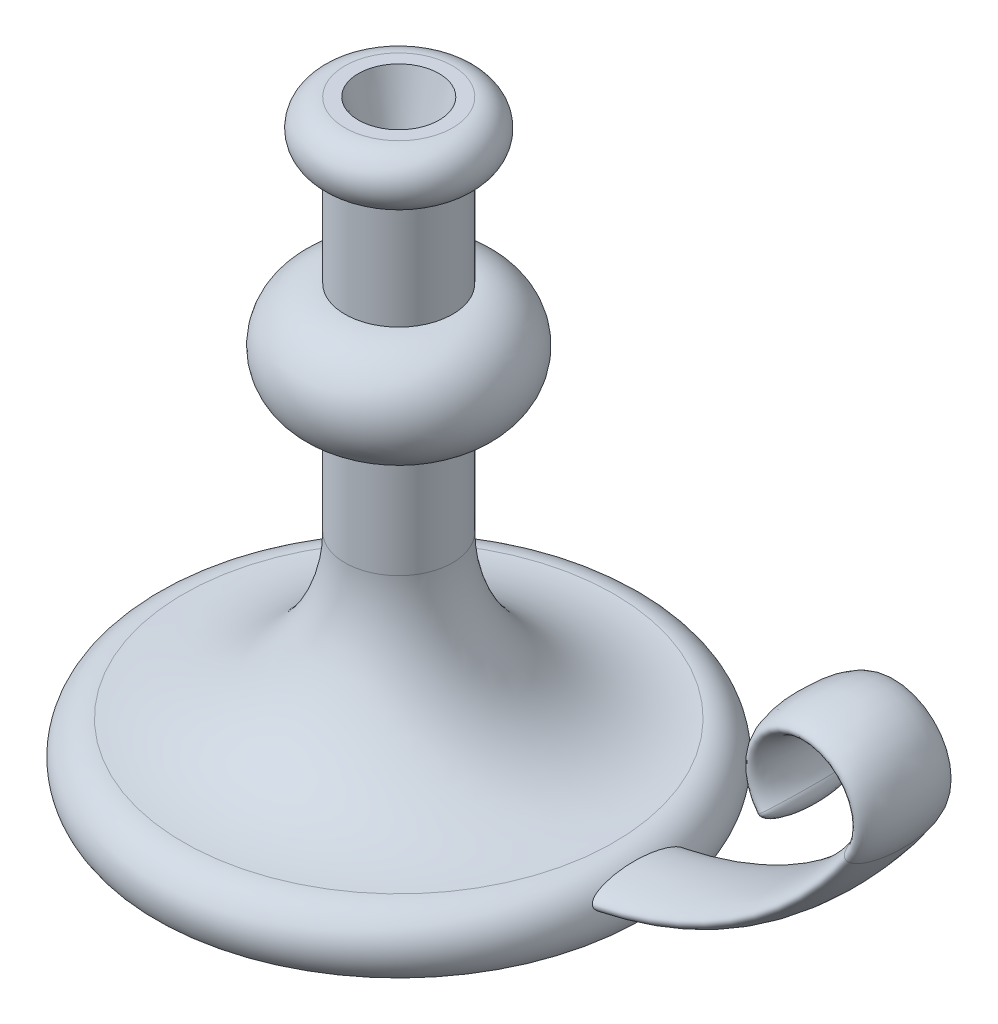
ISO-10303-21;
HEADER;
FILE_DESCRIPTION(('STEP AP214'),'2;1');
FILE_NAME('part.step','',(''),(''),'','','');
FILE_SCHEMA(('AUTOMOTIVE_DESIGN { 1 0 10303 214 1 1 1 1 }'));
ENDSEC;
DATA;
#1=APPLICATION_CONTEXT('core data for automotive mechanical design processes');
#2=APPLICATION_PROTOCOL_DEFINITION('international standard','automotive_design',2000,#1);
#3=PRODUCT_CONTEXT('',#1,'mechanical');
#4=PRODUCT('Part','Part','',(#3));
#5=PRODUCT_RELATED_PRODUCT_CATEGORY('part','',(#4));
#6=PRODUCT_DEFINITION_FORMATION('','',#4);
#7=PRODUCT_DEFINITION_CONTEXT('part definition',#1,'design');
#8=PRODUCT_DEFINITION('design','',#6,#7);
#9=PRODUCT_DEFINITION_SHAPE('','',#8);
#10=(LENGTH_UNIT() NAMED_UNIT(*) SI_UNIT(.MILLI.,.METRE.));
#11=(NAMED_UNIT(*) PLANE_ANGLE_UNIT() SI_UNIT($,.RADIAN.));
#12=(NAMED_UNIT(*) SI_UNIT($,.STERADIAN.) SOLID_ANGLE_UNIT());
#13=UNCERTAINTY_MEASURE_WITH_UNIT(LENGTH_MEASURE(1.E-05),#10,'distance_accuracy_value','');
#14=(GEOMETRIC_REPRESENTATION_CONTEXT(3) GLOBAL_UNCERTAINTY_ASSIGNED_CONTEXT((#13)) GLOBAL_UNIT_ASSIGNED_CONTEXT((#10,
#11,#12)) REPRESENTATION_CONTEXT('',''));
#15=CARTESIAN_POINT('',(0.,0.,0.));
#16=DIRECTION('',(0.,0.,1.));
#17=DIRECTION('',(1.,0.,0.));
#18=AXIS2_PLACEMENT_3D('',#15,#16,#17);
#19=CARTESIAN_POINT('',(0.,0.,0.));
#20=DIRECTION('',(0.,-1.,0.));
#21=DIRECTION('',(0.,0.,-1.));
#22=AXIS2_PLACEMENT_3D('',#19,#20,#21);
#23=PLANE('',#22);
#24=CARTESIAN_POINT('',(0.,0.,0.));
#25=DIRECTION('',(0.,-1.,0.));
#26=DIRECTION('',(0.,0.,-1.));
#27=AXIS2_PLACEMENT_3D('',#24,#25,#26);
#28=CIRCLE('',#27,90.);
#29=CARTESIAN_POINT('',(0.,0.,-90.));
#30=VERTEX_POINT('',#29);
#31=EDGE_CURVE('E69',#30,#30,#28,.T.);
#32=ORIENTED_EDGE('',*,*,#31,.T.);
#33=EDGE_LOOP('',(#32));
#34=FACE_BOUND('',#33,.T.);
#35=ADVANCED_FACE('F47',(#34),#23,.T.);
#36=CARTESIAN_POINT('',(0.,220.,0.));
#37=DIRECTION('',(0.,1.,0.));
#38=DIRECTION('',(0.,0.,1.));
#39=AXIS2_PLACEMENT_3D('',#36,#37,#38);
#40=PLANE('',#39);
#41=CARTESIAN_POINT('',(0.,220.,0.));
#42=DIRECTION('',(0.,1.,0.));
#43=DIRECTION('',(0.,0.,1.));
#44=AXIS2_PLACEMENT_3D('',#41,#42,#43);
#45=CIRCLE('',#44,15.);
#46=CARTESIAN_POINT('',(0.,220.,15.));
#47=VERTEX_POINT('',#46);
#48=EDGE_CURVE('E80',#47,#47,#45,.T.);
#49=ORIENTED_EDGE('',*,*,#48,.F.);
#50=EDGE_LOOP('',(#49));
#51=FACE_BOUND('',#50,.T.);
#52=CARTESIAN_POINT('',(0.,220.,0.));
#53=DIRECTION('',(0.,-1.,0.));
#54=DIRECTION('',(0.,0.,-1.));
#55=AXIS2_PLACEMENT_3D('',#52,#53,#54);
#56=CIRCLE('',#55,20.);
#57=CARTESIAN_POINT('',(0.,220.,-20.));
#58=VERTEX_POINT('',#57);
#59=EDGE_CURVE('E59',#58,#58,#56,.T.);
#60=ORIENTED_EDGE('',*,*,#59,.F.);
#61=EDGE_LOOP('',(#60));
#62=FACE_BOUND('',#61,.T.);
#63=ADVANCED_FACE('F130',(#51,#62),#40,.T.);
#64=CARTESIAN_POINT('',(0.,210.,0.));
#65=DIRECTION('',(0.,-1.,0.));
#66=DIRECTION('',(0.,0.,-1.));
#67=AXIS2_PLACEMENT_3D('',#64,#65,#66);
#68=TOROIDAL_SURFACE('',#67,20.,10.);
#69=ORIENTED_EDGE('',*,*,#59,.T.);
#70=EDGE_LOOP('',(#69));
#71=FACE_BOUND('',#70,.T.);
#72=CARTESIAN_POINT('',(0.,200.,0.));
#73=DIRECTION('',(0.,-1.,0.));
#74=DIRECTION('',(0.,0.,-1.));
#75=AXIS2_PLACEMENT_3D('',#72,#73,#74);
#76=CIRCLE('',#75,20.);
#77=CARTESIAN_POINT('',(0.,200.,-20.));
#78=VERTEX_POINT('',#77);
#79=EDGE_CURVE('E105',#78,#78,#76,.T.);
#80=ORIENTED_EDGE('',*,*,#79,.F.);
#81=EDGE_LOOP('',(#80));
#82=FACE_BOUND('',#81,.T.);
#83=ADVANCED_FACE('F135',(#71,#82),#68,.T.);
#84=CARTESIAN_POINT('',(0.,0.,0.));
#85=DIRECTION('',(0.,-1.,0.));
#86=DIRECTION('',(0.,0.,-1.));
#87=AXIS2_PLACEMENT_3D('',#84,#85,#86);
#88=CYLINDRICAL_SURFACE('',#87,20.);
#89=ORIENTED_EDGE('',*,*,#79,.T.);
#90=EDGE_LOOP('',(#89));
#91=FACE_BOUND('',#90,.T.);
#92=CARTESIAN_POINT('',(0.,160.,0.));
#93=DIRECTION('',(0.,-1.,0.));
#94=DIRECTION('',(0.,0.,-1.));
#95=AXIS2_PLACEMENT_3D('',#92,#93,#94);
#96=CIRCLE('',#95,20.);
#97=CARTESIAN_POINT('',(0.,160.,-20.));
#98=VERTEX_POINT('',#97);
#99=EDGE_CURVE('E108',#98,#98,#96,.T.);
#100=ORIENTED_EDGE('',*,*,#99,.F.);
#101=EDGE_LOOP('',(#100));
#102=FACE_BOUND('',#101,.T.);
#103=ADVANCED_FACE('F141',(#91,#102),#88,.T.);
#104=CARTESIAN_POINT('',(0.,140.,0.));
#105=DIRECTION('',(0.,-1.,0.));
#106=DIRECTION('',(0.,0.,-1.));
#107=AXIS2_PLACEMENT_3D('',#104,#105,#106);
#108=TOROIDAL_SURFACE('',#107,20.,20.);
#109=ORIENTED_EDGE('',*,*,#99,.T.);
#110=EDGE_LOOP('',(#109));
#111=FACE_BOUND('',#110,.T.);
#112=CARTESIAN_POINT('',(0.,120.,0.));
#113=DIRECTION('',(0.,-1.,0.));
#114=DIRECTION('',(0.,0.,-1.));
#115=AXIS2_PLACEMENT_3D('',#112,#113,#114);
#116=CIRCLE('',#115,20.);
#117=CARTESIAN_POINT('',(0.,120.,-20.));
#118=VERTEX_POINT('',#117);
#119=EDGE_CURVE('E111',#118,#118,#116,.T.);
#120=ORIENTED_EDGE('',*,*,#119,.F.);
#121=EDGE_LOOP('',(#120));
#122=FACE_BOUND('',#121,.T.);
#123=ADVANCED_FACE('F127',(#111,#122),#108,.T.);
#124=CARTESIAN_POINT('',(0.,0.,0.));
#125=DIRECTION('',(0.,-1.,0.));
#126=DIRECTION('',(0.,0.,-1.));
#127=AXIS2_PLACEMENT_3D('',#124,#125,#126);
#128=CYLINDRICAL_SURFACE('',#127,20.);
#129=ORIENTED_EDGE('',*,*,#119,.T.);
#130=EDGE_LOOP('',(#129));
#131=FACE_BOUND('',#130,.T.);
#132=CARTESIAN_POINT('',(0.,79.9999999999999,0.));
#133=DIRECTION('',(0.,-1.,0.));
#134=DIRECTION('',(0.,0.,-1.));
#135=AXIS2_PLACEMENT_3D('',#132,#133,#134);
#136=CIRCLE('',#135,20.);
#137=CARTESIAN_POINT('',(0.,79.9999999999999,-20.));
#138=VERTEX_POINT('',#137);
#139=EDGE_CURVE('E114',#138,#138,#136,.T.);
#140=ORIENTED_EDGE('',*,*,#139,.F.);
#141=EDGE_LOOP('',(#140));
#142=FACE_BOUND('',#141,.T.);
#143=ADVANCED_FACE('F122',(#131,#142),#128,.T.);
#144=CARTESIAN_POINT('',(0.,80.,0.));
#145=DIRECTION('',(0.,-1.,0.));
#146=DIRECTION('',(0.,0.,-1.));
#147=AXIS2_PLACEMENT_3D('',#144,#145,#146);
#148=TOROIDAL_SURFACE('',#147,80.,60.);
#149=ORIENTED_EDGE('',*,*,#139,.T.);
#150=EDGE_LOOP('',(#149));
#151=FACE_BOUND('',#150,.T.);
#152=CARTESIAN_POINT('',(0.,20.,0.));
#153=DIRECTION('',(0.,-1.,0.));
#154=DIRECTION('',(0.,0.,-1.));
#155=AXIS2_PLACEMENT_3D('',#152,#153,#154);
#156=CIRCLE('',#155,79.9999999999999);
#157=CARTESIAN_POINT('',(0.,20.,-79.9999999999999));
#158=VERTEX_POINT('',#157);
#159=EDGE_CURVE('E72',#158,#158,#156,.T.);
#160=ORIENTED_EDGE('',*,*,#159,.F.);
#161=EDGE_LOOP('',(#160));
#162=FACE_BOUND('',#161,.T.);
#163=ADVANCED_FACE('F97',(#151,#162),#148,.F.);
#164=CARTESIAN_POINT('',(0.,7.49999999999997,0.));
#165=DIRECTION('',(0.,-1.,0.));
#166=DIRECTION('',(0.,0.,-1.));
#167=AXIS2_PLACEMENT_3D('',#164,#165,#166);
#168=TOROIDAL_SURFACE('',#167,80.,12.5);
#169=CARTESIAN_POINT('',(89.5597422043341,12.9414346567555,-17.5));
#170=CARTESIAN_POINT('',(89.5390682417034,12.9833970763635,-17.499999801476));
#171=CARTESIAN_POINT('',(89.5184948481192,13.0254081758614,-17.4978460786373));
#172=CARTESIAN_POINT('',(89.4777074557659,13.1091783719493,-17.4892930018231));
#173=CARTESIAN_POINT('',(89.4574935851384,13.1509373753176,-17.4828921640349));
#174=CARTESIAN_POINT('',(89.3975656488552,13.275424618129,-17.4575317742508));
#175=CARTESIAN_POINT('',(89.3585930347989,13.3573066164347,-17.4324146791396));
#176=CARTESIAN_POINT('',(89.2734409816765,13.5379175715786,-17.3597432795598));
#177=CARTESIAN_POINT('',(89.2281121247516,13.6353143232492,-17.3079911474062));
#178=CARTESIAN_POINT('',(89.1421571121494,13.8217561384483,-17.188166079603));
#179=CARTESIAN_POINT('',(89.1015411563844,13.9107830112797,-17.1200586894139));
#180=CARTESIAN_POINT('',(89.0298762971165,14.0690143319055,-16.9825248110395));
#181=CARTESIAN_POINT('',(88.9982786842444,14.1392645151031,-16.9145529225411));
#182=CARTESIAN_POINT('',(88.9378306664439,14.2743203741629,-16.7722185271802));
#183=CARTESIAN_POINT('',(88.9089824882069,14.3391216321741,-16.6978509317863));
#184=CARTESIAN_POINT('',(88.8535955575884,14.4639952815646,-16.5441752211162));
#185=CARTESIAN_POINT('',(88.8270622241569,14.5240565470721,-16.46485622146));
#186=CARTESIAN_POINT('',(88.7760324990848,14.6398694069749,-16.3025689169612));
#187=CARTESIAN_POINT('',(88.7515354717388,14.6956223459825,-16.2196017634808));
#188=CARTESIAN_POINT('',(88.7047417294347,14.8022966462375,-16.0524591820992));
#189=CARTESIAN_POINT('',(88.6824111309148,14.8532916472491,-15.9683399173082));
#190=CARTESIAN_POINT('',(88.6391880618339,14.9520793339757,-15.79787361839));
#191=CARTESIAN_POINT('',(88.6182958325685,14.9998714823562,-15.7115262138022));
#192=CARTESIAN_POINT('',(88.5574287556144,15.1391199588383,-15.4495202070302));
#193=CARTESIAN_POINT('',(88.5193306885353,15.226294697945,-15.2711446093403));
#194=CARTESIAN_POINT('',(88.446993084953,15.3914560839503,-14.9093240436536));
#195=CARTESIAN_POINT('',(88.4127567918464,15.4694350100039,-14.7258749732316));
#196=CARTESIAN_POINT('',(88.3472362016713,15.6180770700463,-14.3544014869799));
#197=CARTESIAN_POINT('',(88.3159681826398,15.6887000486783,-14.1663582382782));
#198=CARTESIAN_POINT('',(88.2560646079385,15.8232632193262,-13.7877426015728));
#199=CARTESIAN_POINT('',(88.2274261580788,15.8872107694164,-13.597173264885));
#200=CARTESIAN_POINT('',(88.1723521282147,16.0093779596914,-13.2139752998446));
#201=CARTESIAN_POINT('',(88.1459158137057,16.0675995109174,-13.0213473824982));
#202=CARTESIAN_POINT('',(88.0881587196921,16.1938504755765,-12.5829461756595));
#203=CARTESIAN_POINT('',(88.057408826797,16.2603701176449,-12.3366637905587));
#204=CARTESIAN_POINT('',(87.9985123187221,16.3864590847676,-11.8420048197334));
#205=CARTESIAN_POINT('',(87.9703659750279,16.4460276851697,-11.5936280185532));
#206=CARTESIAN_POINT('',(87.9163482586829,16.5590946330449,-11.0949310622544));
#207=CARTESIAN_POINT('',(87.8904797303634,16.612585414613,-10.8446088905718));
#208=CARTESIAN_POINT('',(87.8408483965671,16.7140512465655,-10.3426370646263));
#209=CARTESIAN_POINT('',(87.8170856939001,16.7620260276842,-10.0909873461855));
#210=CARTESIAN_POINT('',(87.7486691228052,16.898583923083,-9.33377768592114));
#211=CARTESIAN_POINT('',(87.7069540377653,16.97966087202,-8.82658708533074));
#212=CARTESIAN_POINT('',(87.6306961124076,17.1248455016836,-7.80916406760192));
#213=CARTESIAN_POINT('',(87.5961551600074,17.1889487168833,-7.2989308860368));
#214=CARTESIAN_POINT('',(87.5339911377833,17.3022548727761,-6.27558535996727));
#215=CARTESIAN_POINT('',(87.5063790759952,17.3514341291621,-5.76246974165502));
#216=CARTESIAN_POINT('',(87.4581556376937,17.436100662932,-4.73533825840298));
#217=CARTESIAN_POINT('',(87.4375369377591,17.471602268827,-4.22132390532781));
#218=CARTESIAN_POINT('',(87.4033485965417,17.5298933049627,-3.19263203564266));
#219=CARTESIAN_POINT('',(87.3897750436296,17.5526897899013,-2.67795504642817));
#220=CARTESIAN_POINT('',(87.3697503063743,17.586157334674,-1.648164156787));
#221=CARTESIAN_POINT('',(87.3632979000101,17.5968304749382,-1.13305034650892));
#222=CARTESIAN_POINT('',(87.3567446403376,17.60768667733,0.0451925107298317));
#223=CARTESIAN_POINT('',(87.3589979794371,17.6039802512045,0.708375187512295));
#224=CARTESIAN_POINT('',(87.3753603536129,17.5767998431173,2.03444017536747));
#225=CARTESIAN_POINT('',(87.3894738801434,17.5533183723369,2.69732227744506));
#226=CARTESIAN_POINT('',(87.4294012787108,17.4856044911544,4.02207693580371));
#227=CARTESIAN_POINT('',(87.4552221149226,17.441359729014,4.68394865557875));
#228=CARTESIAN_POINT('',(87.5182601373714,17.3304493690439,6.00273083681723));
#229=CARTESIAN_POINT('',(87.5554327085335,17.2638714468588,6.65965058375248));
#230=CARTESIAN_POINT('',(87.6198336832517,17.1447808230946,7.6419645780698));
#231=CARTESIAN_POINT('',(87.642735706184,17.1018902548719,7.96882803392315));
#232=CARTESIAN_POINT('',(87.6915021526184,17.0091104096816,8.62133363379236));
#233=CARTESIAN_POINT('',(87.7173664470652,16.9592214375876,8.94697583037616));
#234=CARTESIAN_POINT('',(87.7721755297607,16.8517641144648,9.59646350792249));
#235=CARTESIAN_POINT('',(87.8011178051594,16.7942020181563,9.92031023084742));
#236=CARTESIAN_POINT('',(87.8623401784715,16.6704243890004,10.5660151582703));
#237=CARTESIAN_POINT('',(87.8946200133658,16.604209537932,10.8878735173476));
#238=CARTESIAN_POINT('',(87.9634236652183,16.4608004427525,11.5338084512996));
#239=CARTESIAN_POINT('',(88.000003820403,16.3834565668026,11.8578460140784));
#240=CARTESIAN_POINT('',(88.0776704479077,16.2167402960612,12.5024294932673));
#241=CARTESIAN_POINT('',(88.1187582871155,16.127364250818,12.8229743179843));
#242=CARTESIAN_POINT('',(88.1845991136114,15.9822640377111,13.3001792679787));
#243=CARTESIAN_POINT('',(88.2072711562738,15.9320048353494,13.4587947763663));
#244=CARTESIAN_POINT('',(88.2542087743505,15.8273740345263,13.7744208617844));
#245=CARTESIAN_POINT('',(88.2784742329896,15.7730027373801,13.9314315554533));
#246=CARTESIAN_POINT('',(88.3288329339648,15.6596363065337,14.2433947335179));
#247=CARTESIAN_POINT('',(88.35492524545,15.6006435258591,14.3983482189411));
#248=CARTESIAN_POINT('',(88.40926963883,15.4773352517471,14.7057236901241));
#249=CARTESIAN_POINT('',(88.4375213946573,15.4130205617763,14.8581460538589));
#250=CARTESIAN_POINT('',(88.496850771984,15.277656295013,15.1609091928659));
#251=CARTESIAN_POINT('',(88.5279487218459,15.2065580859198,15.3112244481864));
#252=CARTESIAN_POINT('',(88.5933850994808,15.056867767975,15.6074204461988));
#253=CARTESIAN_POINT('',(88.6277241675827,14.9782741782727,15.7533003050569));
#254=CARTESIAN_POINT('',(88.700244119066,14.8125407512923,16.0379741363778));
#255=CARTESIAN_POINT('',(88.7383996400976,14.725457419618,16.1768067090681));
#256=CARTESIAN_POINT('',(88.7994889081876,14.5866042208326,16.3782369433242));
#257=CARTESIAN_POINT('',(88.8204977413205,14.5389415031643,16.4442523217283));
#258=CARTESIAN_POINT('',(88.8639845053446,14.4405581400305,16.5734496387427));
#259=CARTESIAN_POINT('',(88.8864621846825,14.3898380182878,16.6366320594137));
#260=CARTESIAN_POINT('',(88.9422432981294,14.2644224068509,16.7835876842878));
#261=CARTESIAN_POINT('',(88.9763364041371,14.1881224618902,16.8657235531488));
#262=CARTESIAN_POINT('',(89.0483213192228,14.0281384901631,17.0203903295102));
#263=CARTESIAN_POINT('',(89.0862061390444,13.9444680822846,17.0929383574416));
#264=CARTESIAN_POINT('',(89.167031158357,13.7675914637806,17.2256585134379));
#265=CARTESIAN_POINT('',(89.2100345714238,13.6742683967952,17.2856436508916));
#266=CARTESIAN_POINT('',(89.2779863638664,13.5285260537448,17.3610498966381));
#267=CARTESIAN_POINT('',(89.3011904906564,13.4790295981974,17.3837437830237));
#268=CARTESIAN_POINT('',(89.3486811224829,13.3783655416197,17.4235815208152));
#269=CARTESIAN_POINT('',(89.3729671592233,13.3271986661309,17.4407277474305));
#270=CARTESIAN_POINT('',(89.4344831171661,13.1984825422746,17.4755813984576));
#271=CARTESIAN_POINT('',(89.4722908092768,13.1201458143804,17.4895469950751));
#272=CARTESIAN_POINT('',(89.5490629639984,12.9628453353418,17.5023227338009));
#273=CARTESIAN_POINT('',(89.5880269032806,12.8838818793669,17.5011396310452));
#274=CARTESIAN_POINT('',(89.6659197904119,12.7278461407113,17.4839019863862));
#275=CARTESIAN_POINT('',(89.7048486189831,12.6507699944095,17.4678809909867));
#276=CARTESIAN_POINT('',(89.7818193498587,12.5001197626209,17.4227133423479));
#277=CARTESIAN_POINT('',(89.8198603575284,12.4265491378824,17.3935540037512));
#278=CARTESIAN_POINT('',(89.913404922189,12.2476534190916,17.306889314573));
#279=CARTESIAN_POINT('',(89.9679590616024,12.145189838998,17.242509370202));
#280=CARTESIAN_POINT('',(90.073047302931,11.9508453333006,17.0967607254894));
#281=CARTESIAN_POINT('',(90.1235693401414,11.8589958245547,17.0153434992539));
#282=CARTESIAN_POINT('',(90.2171397045077,11.6912868202017,16.8474453840347));
#283=CARTESIAN_POINT('',(90.2604644261231,11.614747528578,16.7617815283344));
#284=CARTESIAN_POINT('',(90.3441827817385,11.468646855347,16.5833011975323));
#285=CARTESIAN_POINT('',(90.3845736709582,11.399091985413,16.4904781877889));
#286=CARTESIAN_POINT('',(90.462838175762,11.2658377500047,16.299418801176));
#287=CARTESIAN_POINT('',(90.5007060129827,11.2021517058643,16.2011708808804));
#288=CARTESIAN_POINT('',(90.5741373771351,11.0799532151534,16.0007631563994));
#289=CARTESIAN_POINT('',(90.6097017753897,11.0214388092147,15.8986048549374));
#290=CARTESIAN_POINT('',(90.6798506810777,10.907152801401,15.6881130903977));
#291=CARTESIAN_POINT('',(90.714373715616,10.8515162836042,15.5796863139918));
#292=CARTESIAN_POINT('',(90.7815268547172,10.7443116806167,15.360253281427));
#293=CARTESIAN_POINT('',(90.8141566222408,10.6927443192329,15.2492465708843));
#294=CARTESIAN_POINT('',(90.8777648134741,10.5931040659489,15.0249916383586));
#295=CARTESIAN_POINT('',(90.9087405253422,10.5450368683636,14.911740129013));
#296=CARTESIAN_POINT('',(90.969147198282,10.4520756013787,14.6835311742993));
#297=CARTESIAN_POINT('',(90.99857802156,10.4071818149024,14.5685735779288));
#298=CARTESIAN_POINT('',(91.0847991405982,10.2766779068774,14.2214202083162));
#299=CARTESIAN_POINT('',(91.139475182064,10.1953120661634,13.9870973297885));
#300=CARTESIAN_POINT('',(91.2442711007113,10.0414382528722,13.5131955707374));
#301=CARTESIAN_POINT('',(91.2943656434001,9.96897885185837,13.2735956051528));
#302=CARTESIAN_POINT('',(91.3902100238913,9.83200733702738,12.7915919671125));
#303=CARTESIAN_POINT('',(91.4359646930178,9.76748636146782,12.5491917575469));
#304=CARTESIAN_POINT('',(91.5236096481399,9.6452221988794,12.0620925005013));
#305=CARTESIAN_POINT('',(91.5655011282644,9.58747691594012,11.8173941893179));
#306=CARTESIAN_POINT('',(91.6521116127034,9.4692402793303,11.2872469346838));
#307=CARTESIAN_POINT('',(91.6962295705046,9.40975960214225,11.0014751279237));
#308=CARTESIAN_POINT('',(91.780128347266,9.29775188889056,10.4279264531389));
#309=CARTESIAN_POINT('',(91.8199088096871,9.24522542438239,10.1401494223516));
#310=CARTESIAN_POINT('',(91.8954614399656,9.14632559184647,9.56268010521263));
#311=CARTESIAN_POINT('',(91.9312290206098,9.09995925467001,9.27298601991118));
#312=CARTESIAN_POINT('',(91.9989276864075,9.01286744655503,8.69230014875696));
#313=CARTESIAN_POINT('',(92.0308586021398,8.97214222470754,8.40130830618521));
#314=CARTESIAN_POINT('',(92.1212362536828,8.85762649139313,7.52609730450988));
#315=CARTESIAN_POINT('',(92.1741858932342,8.79160214830164,6.94027690539556));
#316=CARTESIAN_POINT('',(92.2664432393161,8.67757998740403,5.76570323765468));
#317=CARTESIAN_POINT('',(92.3057471215852,8.62958722268867,5.17694919368271));
#318=CARTESIAN_POINT('',(92.3712614806853,8.55005786852539,3.99846267760393));
#319=CARTESIAN_POINT('',(92.3974906208588,8.51849781956184,3.40873281272553));
#320=CARTESIAN_POINT('',(92.4372887662631,8.47075403181841,2.2287671310763));
#321=CARTESIAN_POINT('',(92.4508691565626,8.45455646511362,1.6385322488592));
#322=CARTESIAN_POINT('',(92.4655827970146,8.43701196328739,0.458012213395293));
#323=CARTESIAN_POINT('',(92.4667228078027,8.4356569620781,-0.132272738199177));
#324=CARTESIAN_POINT('',(92.4565896588566,8.44773292337874,-1.31245514860328));
#325=CARTESIAN_POINT('',(92.4453194307781,8.46116039384307,-1.90235266600407));
#326=CARTESIAN_POINT('',(92.4152323530377,8.49720127894754,-2.91293122109444));
#327=CARTESIAN_POINT('',(92.3994886338998,8.5160977132756,-3.333841697338));
#328=CARTESIAN_POINT('',(92.361479293572,8.56194763892809,-4.17492724057184));
#329=CARTESIAN_POINT('',(92.3392138048859,8.58890096655951,-4.5951023223288));
#330=CARTESIAN_POINT('',(92.2880200589701,8.65128092004261,-5.43403090752232));
#331=CARTESIAN_POINT('',(92.2590979156947,8.6866997716845,-5.8527853598129));
#332=CARTESIAN_POINT('',(92.1943469782217,8.76665027127622,-6.68888197534608));
#333=CARTESIAN_POINT('',(92.1585184884653,8.81118151754473,-7.10622420001673));
#334=CARTESIAN_POINT('',(92.0913883463747,8.89546537403426,-7.81486574100227));
#335=CARTESIAN_POINT('',(92.0619223972622,8.93268360129048,-8.10664239641597));
#336=CARTESIAN_POINT('',(91.9992751831022,9.01244031978897,-8.68906573702372));
#337=CARTESIAN_POINT('',(91.9660940114513,9.05497867729228,-8.97971245043327));
#338=CARTESIAN_POINT('',(91.8958362735703,9.1458607932129,-9.55954014433769));
#339=CARTESIAN_POINT('',(91.8587608402545,9.19420286380252,-9.8487215256039));
#340=CARTESIAN_POINT('',(91.7804640727994,9.29733424331959,-10.4253680209943));
#341=CARTESIAN_POINT('',(91.7392428979774,9.35212330450854,-10.7128332006212));
#342=CARTESIAN_POINT('',(91.6651852642245,9.45169652540165,-11.2009114296058));
#343=CARTESIAN_POINT('',(91.6334740038694,9.49464812310358,-11.4020698755366));
#344=CARTESIAN_POINT('',(91.5676939042913,9.58452467572161,-11.8031075358169));
#345=CARTESIAN_POINT('',(91.5336251409519,9.63144950275786,-12.002986791115));
#346=CARTESIAN_POINT('',(91.4629103530434,9.72978070273432,-12.4014607237397));
#347=CARTESIAN_POINT('',(91.4262611401093,9.78119263934914,-12.6000534686834));
#348=CARTESIAN_POINT('',(91.3502044219421,9.88900570641052,-12.9953470629828));
#349=CARTESIAN_POINT('',(91.3107970144912,9.94540666000773,-13.1920479791258));
#350=CARTESIAN_POINT('',(91.227621247349,10.0658223958368,-13.5894074367659));
#351=CARTESIAN_POINT('',(91.1837532035428,10.1300241281653,-13.7899888884266));
#352=CARTESIAN_POINT('',(91.0923799134015,10.2655141547686,-14.1878967143619));
#353=CARTESIAN_POINT('',(91.0448751095603,10.3368015872222,-14.3852234811024));
#354=CARTESIAN_POINT('',(90.9457925667035,10.4876709266085,-14.7751386376168));
#355=CARTESIAN_POINT('',(90.8942241714146,10.567233932421,-14.9677366350486));
#356=CARTESIAN_POINT('',(90.7862143447462,10.7366119201311,-15.3468982086391));
#357=CARTESIAN_POINT('',(90.7297756979318,10.826421053146,-15.5334651502638));
#358=CARTESIAN_POINT('',(90.6212033814506,11.0023988323154,-15.866506496837));
#359=CARTESIAN_POINT('',(90.5700064097104,11.0865232525188,-16.0143454854447));
#360=CARTESIAN_POINT('',(90.489494836853,11.2210719602018,-16.2297682663076));
#361=CARTESIAN_POINT('',(90.4620005609534,11.2673801193725,-16.3006068507302));
#362=CARTESIAN_POINT('',(90.4056638817211,11.3631027215205,-16.4395882553803));
#363=CARTESIAN_POINT('',(90.3768217919371,11.4125164429488,-16.5077316958488));
#364=CARTESIAN_POINT('',(90.317300018792,11.5154431106536,-16.6414688232549));
#365=CARTESIAN_POINT('',(90.2866026931843,11.5689974830707,-16.7070230259591));
#366=CARTESIAN_POINT('',(90.2235248416806,11.6801460587755,-16.8338288983887));
#367=CARTESIAN_POINT('',(90.1911437589193,11.7377416008187,-16.8950791287194));
#368=CARTESIAN_POINT('',(90.1246746009016,11.8572287345164,-17.0118342639455));
#369=CARTESIAN_POINT('',(90.0905922975427,11.9191060427953,-17.0673568649644));
#370=CARTESIAN_POINT('',(90.0205945500682,12.0476162041372,-17.1711750807947));
#371=CARTESIAN_POINT('',(89.9846810936527,12.1142439307013,-17.2194783172414));
#372=CARTESIAN_POINT('',(89.9072691914877,12.2595601926824,-17.3112578352779));
#373=CARTESIAN_POINT('',(89.865573443309,12.3387868393143,-17.3537501287516));
#374=CARTESIAN_POINT('',(89.8018195982588,12.4615624088651,-17.4064482222637));
#375=CARTESIAN_POINT('',(89.7803859732771,12.5031053112559,-17.4221652201571));
#376=CARTESIAN_POINT('',(89.7372110357318,12.5873443592044,-17.4495428289018));
#377=CARTESIAN_POINT('',(89.7154698658712,12.630039977743,-17.4612052607466));
#378=CARTESIAN_POINT('',(89.6713740740642,12.7172109602925,-17.4803130763986));
#379=CARTESIAN_POINT('',(89.6490160377524,12.7617048684967,-17.4876666954994));
#380=CARTESIAN_POINT('',(89.6043139799324,12.8512585298303,-17.4975110322342));
#381=CARTESIAN_POINT('',(89.5819699650796,12.8963184572146,-17.5000002134446));
#382=CARTESIAN_POINT('',(89.5597422043341,12.9414346567555,-17.5));
#383=B_SPLINE_CURVE_WITH_KNOTS('',3,(#169,#170,#171,#172,#173,#174,#175,#176,#177,#178,#179,
#180,#181,#182,#183,#184,#185,#186,#187,#188,#189,#190,#191,#192,#193,#194,#195,#196,#197,#198,
#199,#200,#201,#202,#203,#204,#205,#206,#207,#208,#209,#210,#211,#212,#213,#214,#215,#216,#217,
#218,#219,#220,#221,#222,#223,#224,#225,#226,#227,#228,#229,#230,#231,#232,#233,#234,#235,#236,
#237,#238,#239,#240,#241,#242,#243,#244,#245,#246,#247,#248,#249,#250,#251,#252,#253,#254,#255,
#256,#257,#258,#259,#260,#261,#262,#263,#264,#265,#266,#267,#268,#269,#270,#271,#272,#273,#274,
#275,#276,#277,#278,#279,#280,#281,#282,#283,#284,#285,#286,#287,#288,#289,#290,#291,#292,#293,
#294,#295,#296,#297,#298,#299,#300,#301,#302,#303,#304,#305,#306,#307,#308,#309,#310,#311,#312,
#313,#314,#315,#316,#317,#318,#319,#320,#321,#322,#323,#324,#325,#326,#327,#328,#329,#330,#331,
#332,#333,#334,#335,#336,#337,#338,#339,#340,#341,#342,#343,#344,#345,#346,#347,#348,#349,#350,
#351,#352,#353,#354,#355,#356,#357,#358,#359,#360,#361,#362,#363,#364,#365,#366,#367,#368,#369,
#370,#371,#372,#373,#374,#375,#376,#377,#378,#379,#380,#381,#382),.UNSPECIFIED.,.T.,.F.,(4,2,2,
2,2,2,2,2,2,2,2,2,2,2,2,2,2,2,2,2,2,2,2,2,2,2,2,2,2,2,2,2,2,2,2,2,2,2,2,2,2,2,2,2,2,2,2,2,2,2,2,
2,2,2,2,2,2,2,2,2,2,2,2,2,2,2,2,2,2,2,2,2,2,2,2,2,2,2,2,2,2,2,2,2,2,2,2,2,2,2,2,2,2,2,2,2,2,2,2,
2,2,2,2,2,2,2,4),(0.,0.140282110016982,0.280613256161169,0.561461564225113,0.91722376934168,
1.27374211332864,1.58149644875506,1.88949794489929,2.19820212539496,2.50680956807603,
2.80932632770088,3.11189371339072,3.71792129086042,4.3244541226914,4.93414127512122,
5.54314913395194,6.1519530428662,6.9226740130305,7.69347525989509,8.46522575436349,
9.23701390615391,10.7825344609014,12.3284612151251,13.8768286753813,15.4235696486722,
16.9694509143274,18.5150668584823,20.5042466673037,22.4941801183597,24.4852988514015,
26.4686905809727,27.4599989065234,28.4512640608176,29.4417260743098,30.4321100930449,
31.4373321749622,32.4428599224087,32.9465835692664,33.450270341288,33.9537023077361,
34.457058407555,34.9643418345036,35.4717256930993,35.9759372580764,36.2281107568772,
36.4802411813037,36.8312072460178,37.181537891107,37.5367612141457,37.7140754934881,
37.8913137556322,38.1543004158661,38.4171698086878,38.6794463357447,38.9419766409777,
39.3379141865783,39.7349951838592,40.1027739065873,40.4708923916114,40.8398268646492,
41.2086209556024,41.5884869463128,41.9684203546055,42.3489586609033,42.7295308511807,
43.4911928835032,44.2568399239747,45.0216243573657,45.7861715944801,46.671665270619,
47.5572316789303,48.443800299547,49.3304080553216,51.1055666497823,52.8812223365436,
54.6543360800115,56.4258523070349,58.1964057682271,59.9665410634229,61.2313114732505,
62.4960561883074,63.7596438732784,65.02317587033,65.9099510809945,66.7967040041279,
67.6831996648825,68.569661271387,69.1939827802418,69.8182842027121,70.4433710180343,
71.0684356843185,71.7136688505454,72.3588236340166,73.0025359817354,73.645882695145,
74.1782561728267,74.4451297056956,74.7119414605435,74.9818957429052,75.2519398816508,
75.5211229919354,75.7900198815229,76.0861439670141,76.2339465300025,76.3816826256343,
76.5324603376685,76.6832856648701),.UNSPECIFIED.);
#384=CARTESIAN_POINT('',(89.5597422043341,12.9414346567555,-17.5));
#385=VERTEX_POINT('',#384);
#386=EDGE_CURVE('E13',#385,#385,#383,.T.);
#387=ORIENTED_EDGE('',*,*,#386,.F.);
#388=EDGE_LOOP('',(#387));
#389=FACE_BOUND('',#388,.T.);
#390=ORIENTED_EDGE('',*,*,#159,.T.);
#391=EDGE_LOOP('',(#390));
#392=FACE_BOUND('',#391,.T.);
#393=ORIENTED_EDGE('',*,*,#31,.F.);
#394=EDGE_LOOP('',(#393));
#395=FACE_BOUND('',#394,.T.);
#396=ADVANCED_FACE('F91',(#389,#392,#395),#168,.T.);
#397=CARTESIAN_POINT('',(183.592070943083,75.,0.));
#398=DIRECTION('',(0.566666666666667,0.823947139620552,0.));
#399=DIRECTION('',(0.,0.,-1.));
#400=AXIS2_PLACEMENT_3D('',#397,#398,#399);
#401=ELLIPSE('',#400,17.5,5.);
#402=CARTESIAN_POINT('',(167.113128150672,86.3333333333333,0.));
#403=DIRECTION('',(0.,0.,1.));
#404=AXIS1_PLACEMENT('',#402,#403);
#405=SURFACE_OF_REVOLUTION('',#401,#404);
#406=CARTESIAN_POINT('',(183.592070943083,75.,-17.5));
#407=VERTEX_POINT('',#406);
#408=EDGE_CURVE('E70',#407,#407,#401,.T.);
#409=ORIENTED_EDGE('',*,*,#408,.T.);
#410=EDGE_LOOP('',(#409));
#411=FACE_BOUND('',#410,.T.);
#412=CARTESIAN_POINT('',(151.548780474167,73.7734335962776,-17.5));
#413=CARTESIAN_POINT('',(159.33095431242,80.0533834648056,-17.5));
#414=CARTESIAN_POINT('',(159.33095431242,80.0533834648056,17.5));
#415=CARTESIAN_POINT('',(151.548780474167,73.7734335962776,17.5));
#416=CARTESIAN_POINT('',(143.766606635915,67.4934837277497,17.5));
#417=CARTESIAN_POINT('',(143.766606635915,67.4934837277497,-17.5));
#418=CARTESIAN_POINT('',(151.548780474167,73.7734335962776,-17.5));
#419=(BOUNDED_CURVE() B_SPLINE_CURVE(3,(#412,#413,#414,#415,#416,#417,#418),.UNSPECIFIED.,.T.,
.F.) B_SPLINE_CURVE_WITH_KNOTS((4,3,4),(0.,0.5,1.),
.UNSPECIFIED.) CURVE() GEOMETRIC_REPRESENTATION_ITEM() RATIONAL_B_SPLINE_CURVE((1.,
0.333333333333333,0.333333333333333,1.,0.333333333333333,0.333333333333333,1.)) REPRESENTATION_ITEM(''));
#420=CARTESIAN_POINT('',(151.548780474167,73.7734335962776,-17.5));
#421=VERTEX_POINT('',#420);
#422=EDGE_CURVE('E53',#421,#421,#419,.T.);
#423=ORIENTED_EDGE('',*,*,#422,.F.);
#424=EDGE_LOOP('',(#423));
#425=FACE_BOUND('',#424,.T.);
#426=ADVANCED_FACE('F87',(#411,#425),#405,.F.);
#427=CARTESIAN_POINT('',(60.,9.99999999999999,0.));
#428=DIRECTION('',(1.,0.,0.));
#429=DIRECTION('',(0.,0.,-1.));
#430=AXIS2_PLACEMENT_3D('',#427,#428,#429);
#431=ELLIPSE('',#430,17.5,5.);
#432=CARTESIAN_POINT('',(60.,160.,0.));
#433=DIRECTION('',(0.,0.,1.));
#434=AXIS1_PLACEMENT('',#432,#433);
#435=SURFACE_OF_REVOLUTION('',#431,#434);
#436=ORIENTED_EDGE('',*,*,#386,.T.);
#437=EDGE_LOOP('',(#436));
#438=FACE_BOUND('',#437,.T.);
#439=ORIENTED_EDGE('',*,*,#408,.F.);
#440=EDGE_LOOP('',(#439));
#441=FACE_BOUND('',#440,.T.);
#442=ADVANCED_FACE('F65',(#438,#441),#435,.F.);
#443=CARTESIAN_POINT('',(151.548780474167,73.7734335962776,-17.5));
#444=CARTESIAN_POINT('',(154.688755408431,69.8823466771516,-17.5));
#445=CARTESIAN_POINT('',(154.688755408431,69.8823466771516,0.));
#446=CARTESIAN_POINT('',(159.33095431242,80.0533834648056,-17.5));
#447=CARTESIAN_POINT('',(162.470929246684,76.1622965456795,-17.5));
#448=CARTESIAN_POINT('',(154.688755408431,69.8823466771516,0.));
#449=CARTESIAN_POINT('',(159.33095431242,80.0533834648056,17.5));
#450=CARTESIAN_POINT('',(162.470929246684,76.1622965456795,17.5));
#451=CARTESIAN_POINT('',(154.688755408431,69.8823466771516,0.));
#452=CARTESIAN_POINT('',(151.548780474167,73.7734335962776,17.5));
#453=CARTESIAN_POINT('',(154.688755408431,69.8823466771516,17.5));
#454=CARTESIAN_POINT('',(154.688755408431,69.8823466771516,0.));
#455=CARTESIAN_POINT('',(143.766606635915,67.4934837277497,17.5));
#456=CARTESIAN_POINT('',(146.906581570179,63.6023968086236,17.5));
#457=CARTESIAN_POINT('',(154.688755408431,69.8823466771516,0.));
#458=CARTESIAN_POINT('',(143.766606635915,67.4934837277497,-17.5));
#459=CARTESIAN_POINT('',(146.906581570179,63.6023968086236,-17.5));
#460=CARTESIAN_POINT('',(154.688755408431,69.8823466771516,0.));
#461=CARTESIAN_POINT('',(151.548780474167,73.7734335962776,-17.5));
#462=CARTESIAN_POINT('',(154.688755408431,69.8823466771516,-17.5));
#463=CARTESIAN_POINT('',(154.688755408431,69.8823466771516,0.));
#464=(BOUNDED_SURFACE() B_SPLINE_SURFACE(3,2,((#443,#444,#445),(#446,#447,#448),(#449,#450,
#451),(#452,#453,#454),(#455,#456,#457),(#458,#459,#460),(#461,#462,#463)),.UNSPECIFIED.,.T.,
.F.,.F.) B_SPLINE_SURFACE_WITH_KNOTS((4,3,4),(3,3),(0.,0.5,1.),(0.,1.),
.UNSPECIFIED.) GEOMETRIC_REPRESENTATION_ITEM() RATIONAL_B_SPLINE_SURFACE(((1.,0.707106781186548,
1.),(0.333333333333333,0.235702260395516,0.333333333333333),(0.333333333333333,
0.235702260395516,0.333333333333333),(1.,0.707106781186548,1.),(0.333333333333333,
0.235702260395516,0.333333333333333),(0.333333333333333,0.235702260395516,0.333333333333333),
(1.,0.707106781186548,1.))) REPRESENTATION_ITEM('') SURFACE());
#465=CARTESIAN_POINT('',(154.688755408431,69.8823466771516,0.));
#466=VERTEX_POINT('',#465);
#467=VERTEX_LOOP('',#466);
#468=FACE_BOUND('',#467,.T.);
#469=ORIENTED_EDGE('',*,*,#422,.T.);
#470=EDGE_LOOP('',(#469));
#471=FACE_BOUND('',#470,.T.);
#472=ADVANCED_FACE('F49',(#468,#471),#464,.T.);
#473=CARTESIAN_POINT('',(0.,220.,0.));
#474=DIRECTION('',(0.,1.,0.));
#475=DIRECTION('',(0.,0.,1.));
#476=AXIS2_PLACEMENT_3D('',#473,#474,#475);
#477=CONICAL_SURFACE('',#476,15.,0.26179938779915);
#478=CARTESIAN_POINT('',(0.,195.,0.));
#479=DIRECTION('',(0.,1.,0.));
#480=DIRECTION('',(0.,0.,1.));
#481=AXIS2_PLACEMENT_3D('',#478,#479,#480);
#482=CIRCLE('',#481,8.30127018922192);
#483=CARTESIAN_POINT('',(0.,195.,8.30127018922192));
#484=VERTEX_POINT('',#483);
#485=EDGE_CURVE('E75',#484,#484,#482,.T.);
#486=ORIENTED_EDGE('',*,*,#485,.F.);
#487=EDGE_LOOP('',(#486));
#488=FACE_BOUND('',#487,.T.);
#489=ORIENTED_EDGE('',*,*,#48,.T.);
#490=EDGE_LOOP('',(#489));
#491=FACE_BOUND('',#490,.T.);
#492=ADVANCED_FACE('F64',(#488,#491),#477,.F.);
#493=CARTESIAN_POINT('',(0.,195.,0.));
#494=DIRECTION('',(0.,1.,0.));
#495=DIRECTION('',(0.,0.,1.));
#496=AXIS2_PLACEMENT_3D('',#493,#494,#495);
#497=PLANE('',#496);
#498=ORIENTED_EDGE('',*,*,#485,.T.);
#499=EDGE_LOOP('',(#498));
#500=FACE_BOUND('',#499,.T.);
#501=ADVANCED_FACE('F209',(#500),#497,.T.);
#502=CLOSED_SHELL('',(#35,#63,#83,#103,#123,#143,#163,#396,#426,#442,#472,#492,#501));
#503=MANIFOLD_SOLID_BREP('B2',#502);
#504=ADVANCED_BREP_SHAPE_REPRESENTATION('',(#18,#503),#14);
#505=SHAPE_DEFINITION_REPRESENTATION(#9,#504);
ENDSEC;
END-ISO-10303-21;
